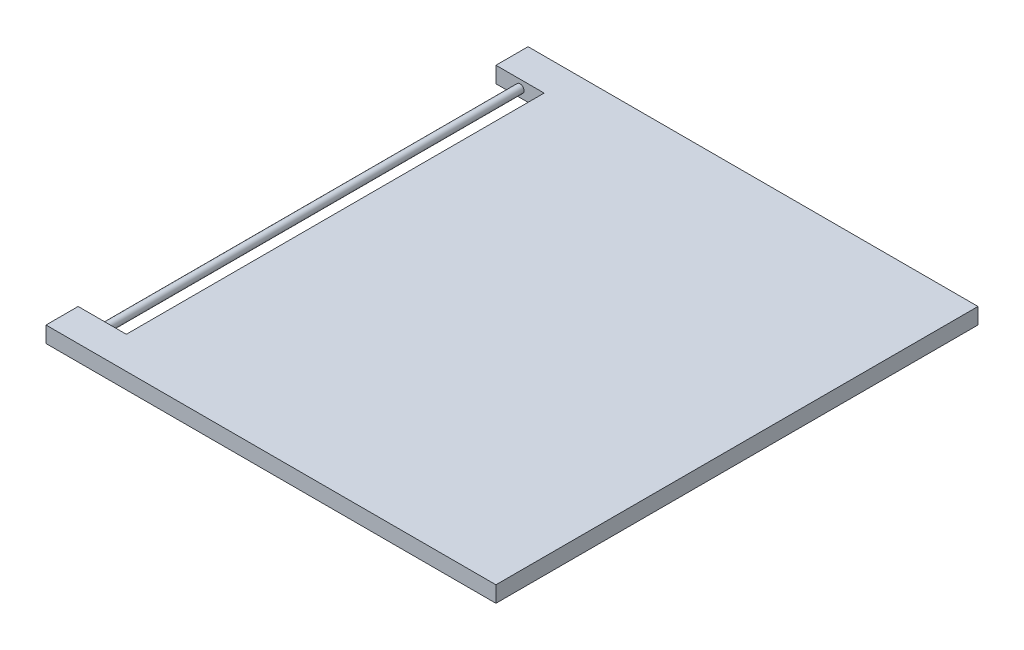
ISO-10303-21;
HEADER;
FILE_DESCRIPTION(('STEP AP214'),'2;1');
FILE_NAME('part.step','',(''),(''),'','','');
FILE_SCHEMA(('AUTOMOTIVE_DESIGN { 1 0 10303 214 1 1 1 1 }'));
ENDSEC;
DATA;
#1=APPLICATION_CONTEXT('core data for automotive mechanical design processes');
#2=APPLICATION_PROTOCOL_DEFINITION('international standard','automotive_design',2000,#1);
#3=PRODUCT_CONTEXT('',#1,'mechanical');
#4=PRODUCT('Part','Part','',(#3));
#5=PRODUCT_RELATED_PRODUCT_CATEGORY('part','',(#4));
#6=PRODUCT_DEFINITION_FORMATION('','',#4);
#7=PRODUCT_DEFINITION_CONTEXT('part definition',#1,'design');
#8=PRODUCT_DEFINITION('design','',#6,#7);
#9=PRODUCT_DEFINITION_SHAPE('','',#8);
#10=(LENGTH_UNIT() NAMED_UNIT(*) SI_UNIT(.MILLI.,.METRE.));
#11=(NAMED_UNIT(*) PLANE_ANGLE_UNIT() SI_UNIT($,.RADIAN.));
#12=(NAMED_UNIT(*) SI_UNIT($,.STERADIAN.) SOLID_ANGLE_UNIT());
#13=UNCERTAINTY_MEASURE_WITH_UNIT(LENGTH_MEASURE(1.E-05),#10,'distance_accuracy_value','');
#14=(GEOMETRIC_REPRESENTATION_CONTEXT(3) GLOBAL_UNCERTAINTY_ASSIGNED_CONTEXT((#13)) GLOBAL_UNIT_ASSIGNED_CONTEXT((#10,
#11,#12)) REPRESENTATION_CONTEXT('',''));
#15=CARTESIAN_POINT('',(0.,0.,0.));
#16=DIRECTION('',(0.,0.,1.));
#17=DIRECTION('',(1.,0.,0.));
#18=AXIS2_PLACEMENT_3D('',#15,#16,#17);
#19=CARTESIAN_POINT('',(-108.720930232558,10.,-86.9186046511628));
#20=DIRECTION('',(1.,0.,0.));
#21=DIRECTION('',(0.,0.,-1.));
#22=AXIS2_PLACEMENT_3D('',#19,#20,#21);
#23=PLANE('',#22);
#24=DIRECTION('',(0.,-1.,0.));
#25=VECTOR('',#24,1.);
#26=CARTESIAN_POINT('',(-108.720930232558,10.,193.081395348837));
#27=LINE('',#26,#25);
#28=CARTESIAN_POINT('',(-108.720930232558,10.,193.081395348837));
#29=VERTEX_POINT('',#28);
#30=CARTESIAN_POINT('',(-108.720930232558,0.,193.081395348837));
#31=VERTEX_POINT('',#30);
#32=EDGE_CURVE('E49',#29,#31,#27,.T.);
#33=ORIENTED_EDGE('',*,*,#32,.F.);
#34=DIRECTION('',(0.,0.,1.));
#35=VECTOR('',#34,1.);
#36=CARTESIAN_POINT('',(-108.720930232558,10.,-86.9186046511628));
#37=LINE('',#36,#35);
#38=CARTESIAN_POINT('',(-108.720930232558,10.,-66.9186046511628));
#39=VERTEX_POINT('',#38);
#40=EDGE_CURVE('E154',#39,#29,#37,.T.);
#41=ORIENTED_EDGE('',*,*,#40,.F.);
#42=DIRECTION('',(0.,1.,0.));
#43=VECTOR('',#42,1.);
#44=CARTESIAN_POINT('',(-108.720930232558,10.,-66.9186046511628));
#45=LINE('',#44,#43);
#46=CARTESIAN_POINT('',(-108.720930232558,0.,-66.9186046511628));
#47=VERTEX_POINT('',#46);
#48=EDGE_CURVE('E130',#47,#39,#45,.T.);
#49=ORIENTED_EDGE('',*,*,#48,.F.);
#50=DIRECTION('',(0.,0.,1.));
#51=VECTOR('',#50,1.);
#52=CARTESIAN_POINT('',(-108.720930232558,0.,-86.9186046511628));
#53=LINE('',#52,#51);
#54=EDGE_CURVE('E54',#47,#31,#53,.T.);
#55=ORIENTED_EDGE('',*,*,#54,.T.);
#56=EDGE_LOOP('',(#33,#41,#49,#55));
#57=FACE_BOUND('',#56,.T.);
#58=ADVANCED_FACE('F34',(#57),#23,.F.);
#59=CARTESIAN_POINT('',(-108.720930232558,10.,213.081395348837));
#60=DIRECTION('',(0.,0.,-1.));
#61=DIRECTION('',(-1.,0.,0.));
#62=AXIS2_PLACEMENT_3D('',#59,#60,#61);
#63=PLANE('',#62);
#64=DIRECTION('',(1.,0.,0.));
#65=VECTOR('',#64,1.);
#66=CARTESIAN_POINT('',(-108.720930232558,0.,213.081395348837));
#67=LINE('',#66,#65);
#68=CARTESIAN_POINT('',(-138.720930232558,0.,213.081395348837));
#69=VERTEX_POINT('',#68);
#70=CARTESIAN_POINT('',(141.279069767442,0.,213.081395348837));
#71=VERTEX_POINT('',#70);
#72=EDGE_CURVE('E148',#69,#71,#67,.T.);
#73=ORIENTED_EDGE('',*,*,#72,.T.);
#74=DIRECTION('',(0.,-1.,0.));
#75=VECTOR('',#74,1.);
#76=CARTESIAN_POINT('',(141.279069767442,10.,213.081395348837));
#77=LINE('',#76,#75);
#78=CARTESIAN_POINT('',(141.279069767442,10.,213.081395348837));
#79=VERTEX_POINT('',#78);
#80=EDGE_CURVE('E102',#79,#71,#77,.T.);
#81=ORIENTED_EDGE('',*,*,#80,.F.);
#82=DIRECTION('',(1.,0.,0.));
#83=VECTOR('',#82,1.);
#84=CARTESIAN_POINT('',(-108.720930232558,10.,213.081395348837));
#85=LINE('',#84,#83);
#86=CARTESIAN_POINT('',(-138.720930232558,10.,213.081395348837));
#87=VERTEX_POINT('',#86);
#88=EDGE_CURVE('E97',#87,#79,#85,.T.);
#89=ORIENTED_EDGE('',*,*,#88,.F.);
#90=DIRECTION('',(0.,1.,0.));
#91=VECTOR('',#90,1.);
#92=CARTESIAN_POINT('',(-138.720930232558,10.,213.081395348837));
#93=LINE('',#92,#91);
#94=EDGE_CURVE('E101',#69,#87,#93,.T.);
#95=ORIENTED_EDGE('',*,*,#94,.F.);
#96=EDGE_LOOP('',(#73,#81,#89,#95));
#97=FACE_BOUND('',#96,.T.);
#98=ADVANCED_FACE('F36',(#97),#63,.F.);
#99=CARTESIAN_POINT('',(141.279069767442,10.,-86.9186046511628));
#100=DIRECTION('',(1.,0.,0.));
#101=DIRECTION('',(0.,0.,-1.));
#102=AXIS2_PLACEMENT_3D('',#99,#100,#101);
#103=PLANE('',#102);
#104=DIRECTION('',(0.,0.,1.));
#105=VECTOR('',#104,1.);
#106=CARTESIAN_POINT('',(141.279069767442,0.,-86.9186046511628));
#107=LINE('',#106,#105);
#108=CARTESIAN_POINT('',(141.279069767442,0.,-86.9186046511628));
#109=VERTEX_POINT('',#108);
#110=EDGE_CURVE('E158',#109,#71,#107,.T.);
#111=ORIENTED_EDGE('',*,*,#110,.F.);
#112=DIRECTION('',(0.,-1.,0.));
#113=VECTOR('',#112,1.);
#114=CARTESIAN_POINT('',(141.279069767442,10.,-86.9186046511628));
#115=LINE('',#114,#113);
#116=CARTESIAN_POINT('',(141.279069767442,10.,-86.9186046511628));
#117=VERTEX_POINT('',#116);
#118=EDGE_CURVE('E156',#117,#109,#115,.T.);
#119=ORIENTED_EDGE('',*,*,#118,.F.);
#120=DIRECTION('',(0.,0.,1.));
#121=VECTOR('',#120,1.);
#122=CARTESIAN_POINT('',(141.279069767442,10.,-86.9186046511628));
#123=LINE('',#122,#121);
#124=EDGE_CURVE('E106',#117,#79,#123,.T.);
#125=ORIENTED_EDGE('',*,*,#124,.T.);
#126=ORIENTED_EDGE('',*,*,#80,.T.);
#127=EDGE_LOOP('',(#111,#119,#125,#126));
#128=FACE_BOUND('',#127,.T.);
#129=ADVANCED_FACE('F183',(#128),#103,.T.);
#130=CARTESIAN_POINT('',(-108.720930232558,10.,-86.9186046511628));
#131=DIRECTION('',(0.,0.,-1.));
#132=DIRECTION('',(-1.,0.,0.));
#133=AXIS2_PLACEMENT_3D('',#130,#131,#132);
#134=PLANE('',#133);
#135=DIRECTION('',(1.,0.,0.));
#136=VECTOR('',#135,1.);
#137=CARTESIAN_POINT('',(-108.720930232558,0.,-86.9186046511628));
#138=LINE('',#137,#136);
#139=CARTESIAN_POINT('',(-138.720930232558,0.,-86.9186046511628));
#140=VERTEX_POINT('',#139);
#141=EDGE_CURVE('E161',#140,#109,#138,.T.);
#142=ORIENTED_EDGE('',*,*,#141,.F.);
#143=DIRECTION('',(0.,-1.,0.));
#144=VECTOR('',#143,1.);
#145=CARTESIAN_POINT('',(-138.720930232558,10.,-86.9186046511628));
#146=LINE('',#145,#144);
#147=CARTESIAN_POINT('',(-138.720930232558,10.,-86.9186046511628));
#148=VERTEX_POINT('',#147);
#149=EDGE_CURVE('E131',#148,#140,#146,.T.);
#150=ORIENTED_EDGE('',*,*,#149,.F.);
#151=DIRECTION('',(1.,0.,0.));
#152=VECTOR('',#151,1.);
#153=CARTESIAN_POINT('',(-108.720930232558,10.,-86.9186046511628));
#154=LINE('',#153,#152);
#155=EDGE_CURVE('E151',#148,#117,#154,.T.);
#156=ORIENTED_EDGE('',*,*,#155,.T.);
#157=ORIENTED_EDGE('',*,*,#118,.T.);
#158=EDGE_LOOP('',(#142,#150,#156,#157));
#159=FACE_BOUND('',#158,.T.);
#160=ADVANCED_FACE('F187',(#159),#134,.T.);
#161=CARTESIAN_POINT('',(0.,10.,0.));
#162=DIRECTION('',(0.,-1.,0.));
#163=DIRECTION('',(0.,0.,-1.));
#164=AXIS2_PLACEMENT_3D('',#161,#162,#163);
#165=PLANE('',#164);
#166=ORIENTED_EDGE('',*,*,#88,.T.);
#167=ORIENTED_EDGE('',*,*,#124,.F.);
#168=ORIENTED_EDGE('',*,*,#155,.F.);
#169=DIRECTION('',(0.,0.,-1.));
#170=VECTOR('',#169,1.);
#171=CARTESIAN_POINT('',(-138.720930232558,10.,-86.9186046511628));
#172=LINE('',#171,#170);
#173=CARTESIAN_POINT('',(-138.720930232558,10.,-66.9186046511628));
#174=VERTEX_POINT('',#173);
#175=EDGE_CURVE('E138',#174,#148,#172,.T.);
#176=ORIENTED_EDGE('',*,*,#175,.F.);
#177=DIRECTION('',(1.,0.,0.));
#178=VECTOR('',#177,1.);
#179=CARTESIAN_POINT('',(-138.720930232558,10.,-66.9186046511628));
#180=LINE('',#179,#178);
#181=EDGE_CURVE('E141',#174,#39,#180,.T.);
#182=ORIENTED_EDGE('',*,*,#181,.T.);
#183=ORIENTED_EDGE('',*,*,#40,.T.);
#184=DIRECTION('',(1.,0.,0.));
#185=VECTOR('',#184,1.);
#186=CARTESIAN_POINT('',(-138.720930232558,10.,193.081395348837));
#187=LINE('',#186,#185);
#188=CARTESIAN_POINT('',(-138.720930232558,10.,193.081395348837));
#189=VERTEX_POINT('',#188);
#190=EDGE_CURVE('E112',#189,#29,#187,.T.);
#191=ORIENTED_EDGE('',*,*,#190,.F.);
#192=DIRECTION('',(0.,0.,-1.));
#193=VECTOR('',#192,1.);
#194=CARTESIAN_POINT('',(-138.720930232558,10.,213.081395348837));
#195=LINE('',#194,#193);
#196=EDGE_CURVE('E109',#87,#189,#195,.T.);
#197=ORIENTED_EDGE('',*,*,#196,.F.);
#198=EDGE_LOOP('',(#166,#167,#168,#176,#182,#183,#191,#197));
#199=FACE_BOUND('',#198,.T.);
#200=ADVANCED_FACE('F110',(#199),#165,.F.);
#201=CARTESIAN_POINT('',(0.,0.,0.));
#202=DIRECTION('',(0.,-1.,0.));
#203=DIRECTION('',(0.,0.,-1.));
#204=AXIS2_PLACEMENT_3D('',#201,#202,#203);
#205=PLANE('',#204);
#206=ORIENTED_EDGE('',*,*,#72,.F.);
#207=DIRECTION('',(0.,0.,1.));
#208=VECTOR('',#207,1.);
#209=CARTESIAN_POINT('',(-138.720930232558,0.,213.081395348837));
#210=LINE('',#209,#208);
#211=CARTESIAN_POINT('',(-138.720930232558,0.,193.081395348837));
#212=VERTEX_POINT('',#211);
#213=EDGE_CURVE('E120',#212,#69,#210,.T.);
#214=ORIENTED_EDGE('',*,*,#213,.F.);
#215=DIRECTION('',(1.,0.,0.));
#216=VECTOR('',#215,1.);
#217=CARTESIAN_POINT('',(-138.720930232558,0.,193.081395348837));
#218=LINE('',#217,#216);
#219=EDGE_CURVE('E125',#212,#31,#218,.T.);
#220=ORIENTED_EDGE('',*,*,#219,.T.);
#221=ORIENTED_EDGE('',*,*,#54,.F.);
#222=DIRECTION('',(1.,0.,0.));
#223=VECTOR('',#222,1.);
#224=CARTESIAN_POINT('',(-138.720930232558,0.,-66.9186046511628));
#225=LINE('',#224,#223);
#226=CARTESIAN_POINT('',(-138.720930232558,0.,-66.9186046511628));
#227=VERTEX_POINT('',#226);
#228=EDGE_CURVE('E146',#227,#47,#225,.T.);
#229=ORIENTED_EDGE('',*,*,#228,.F.);
#230=DIRECTION('',(0.,0.,1.));
#231=VECTOR('',#230,1.);
#232=CARTESIAN_POINT('',(-138.720930232558,0.,-86.9186046511628));
#233=LINE('',#232,#231);
#234=EDGE_CURVE('E134',#140,#227,#233,.T.);
#235=ORIENTED_EDGE('',*,*,#234,.F.);
#236=ORIENTED_EDGE('',*,*,#141,.T.);
#237=ORIENTED_EDGE('',*,*,#110,.T.);
#238=EDGE_LOOP('',(#206,#214,#220,#221,#229,#235,#236,#237));
#239=FACE_BOUND('',#238,.T.);
#240=ADVANCED_FACE('F178',(#239),#205,.T.);
#241=CARTESIAN_POINT('',(-138.720930232558,10.,-66.9186046511628));
#242=DIRECTION('',(0.,0.,-1.));
#243=DIRECTION('',(-1.,0.,0.));
#244=AXIS2_PLACEMENT_3D('',#241,#242,#243);
#245=PLANE('',#244);
#246=CARTESIAN_POINT('',(-123.720930232558,5.,-66.9186046511628));
#247=DIRECTION('',(0.,0.,-1.));
#248=DIRECTION('',(-1.,0.,0.));
#249=AXIS2_PLACEMENT_3D('',#246,#247,#248);
#250=CIRCLE('',#249,2.50000000000001);
#251=CARTESIAN_POINT('',(-126.220930232558,5.,-66.9186046511628));
#252=VERTEX_POINT('',#251);
#253=EDGE_CURVE('E11',#252,#252,#250,.F.);
#254=ORIENTED_EDGE('',*,*,#253,.F.);
#255=EDGE_LOOP('',(#254));
#256=FACE_BOUND('',#255,.T.);
#257=ORIENTED_EDGE('',*,*,#48,.T.);
#258=ORIENTED_EDGE('',*,*,#181,.F.);
#259=DIRECTION('',(0.,1.,0.));
#260=VECTOR('',#259,1.);
#261=CARTESIAN_POINT('',(-138.720930232558,10.,-66.9186046511628));
#262=LINE('',#261,#260);
#263=EDGE_CURVE('E136',#227,#174,#262,.T.);
#264=ORIENTED_EDGE('',*,*,#263,.F.);
#265=ORIENTED_EDGE('',*,*,#228,.T.);
#266=EDGE_LOOP('',(#257,#258,#264,#265));
#267=FACE_BOUND('',#266,.T.);
#268=ADVANCED_FACE('F192',(#256,#267),#245,.F.);
#269=CARTESIAN_POINT('',(-138.720930232558,0.,0.));
#270=DIRECTION('',(-1.,0.,0.));
#271=DIRECTION('',(0.,0.,1.));
#272=AXIS2_PLACEMENT_3D('',#269,#270,#271);
#273=PLANE('',#272);
#274=ORIENTED_EDGE('',*,*,#149,.T.);
#275=ORIENTED_EDGE('',*,*,#234,.T.);
#276=ORIENTED_EDGE('',*,*,#263,.T.);
#277=ORIENTED_EDGE('',*,*,#175,.T.);
#278=EDGE_LOOP('',(#274,#275,#276,#277));
#279=FACE_BOUND('',#278,.T.);
#280=ADVANCED_FACE('F174',(#279),#273,.T.);
#281=CARTESIAN_POINT('',(-138.720930232558,10.,193.081395348837));
#282=DIRECTION('',(0.,0.,1.));
#283=DIRECTION('',(1.,0.,0.));
#284=AXIS2_PLACEMENT_3D('',#281,#282,#283);
#285=PLANE('',#284);
#286=CARTESIAN_POINT('',(-123.720930232558,5.,193.081395348837));
#287=DIRECTION('',(0.,0.,1.));
#288=DIRECTION('',(1.,0.,0.));
#289=AXIS2_PLACEMENT_3D('',#286,#287,#288);
#290=CIRCLE('',#289,2.50000000000001);
#291=CARTESIAN_POINT('',(-121.220930232558,5.,193.081395348837));
#292=VERTEX_POINT('',#291);
#293=EDGE_CURVE('E42',#292,#292,#290,.F.);
#294=ORIENTED_EDGE('',*,*,#293,.F.);
#295=EDGE_LOOP('',(#294));
#296=FACE_BOUND('',#295,.T.);
#297=ORIENTED_EDGE('',*,*,#32,.T.);
#298=ORIENTED_EDGE('',*,*,#219,.F.);
#299=DIRECTION('',(0.,-1.,0.));
#300=VECTOR('',#299,1.);
#301=CARTESIAN_POINT('',(-138.720930232558,10.,193.081395348837));
#302=LINE('',#301,#300);
#303=EDGE_CURVE('E115',#189,#212,#302,.T.);
#304=ORIENTED_EDGE('',*,*,#303,.F.);
#305=ORIENTED_EDGE('',*,*,#190,.T.);
#306=EDGE_LOOP('',(#297,#298,#304,#305));
#307=FACE_BOUND('',#306,.T.);
#308=ADVANCED_FACE('F171',(#296,#307),#285,.F.);
#309=CARTESIAN_POINT('',(-138.720930232558,0.,0.));
#310=DIRECTION('',(1.,0.,0.));
#311=DIRECTION('',(0.,0.,-1.));
#312=AXIS2_PLACEMENT_3D('',#309,#310,#311);
#313=PLANE('',#312);
#314=ORIENTED_EDGE('',*,*,#94,.T.);
#315=ORIENTED_EDGE('',*,*,#196,.T.);
#316=ORIENTED_EDGE('',*,*,#303,.T.);
#317=ORIENTED_EDGE('',*,*,#213,.T.);
#318=EDGE_LOOP('',(#314,#315,#316,#317));
#319=FACE_BOUND('',#318,.T.);
#320=ADVANCED_FACE('F118',(#319),#313,.F.);
#321=CARTESIAN_POINT('',(-123.720930232558,5.,200.152463160703));
#322=DIRECTION('',(0.,0.,-1.));
#323=DIRECTION('',(-1.,0.,0.));
#324=AXIS2_PLACEMENT_3D('',#321,#322,#323);
#325=CYLINDRICAL_SURFACE('',#324,2.50000000000001);
#326=ORIENTED_EDGE('',*,*,#253,.T.);
#327=EDGE_LOOP('',(#326));
#328=FACE_BOUND('',#327,.T.);
#329=ORIENTED_EDGE('',*,*,#293,.T.);
#330=EDGE_LOOP('',(#329));
#331=FACE_BOUND('',#330,.T.);
#332=ADVANCED_FACE('F169',(#328,#331),#325,.T.);
#333=CLOSED_SHELL('',(#58,#98,#129,#160,#200,#240,#268,#280,#308,#320,#332));
#334=MANIFOLD_SOLID_BREP('B2',#333);
#335=ADVANCED_BREP_SHAPE_REPRESENTATION('',(#18,#334),#14);
#336=SHAPE_DEFINITION_REPRESENTATION(#9,#335);
ENDSEC;
END-ISO-10303-21;
